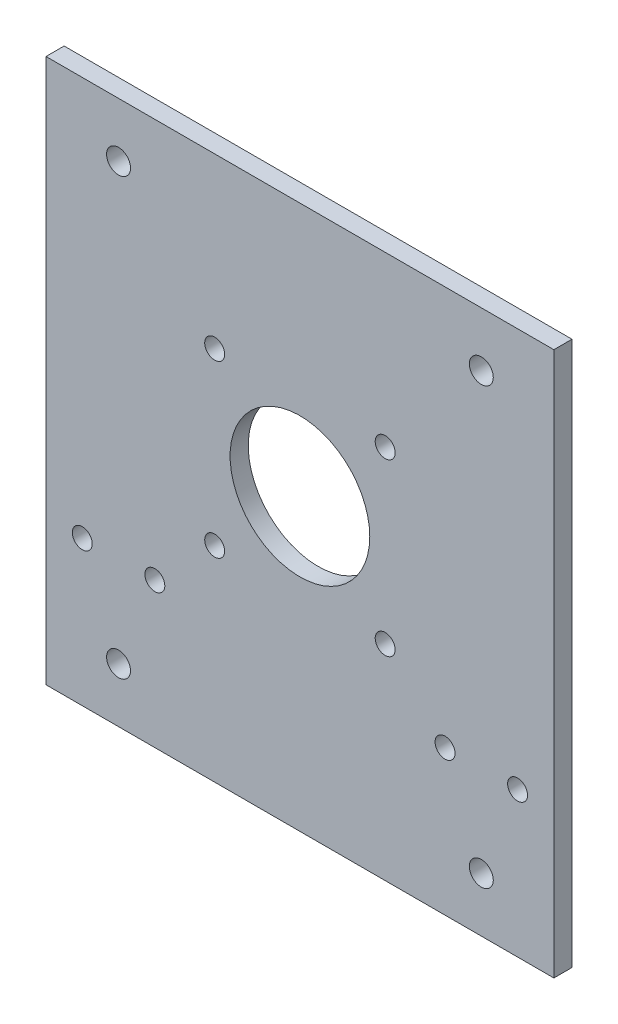
ISO-10303-21;
HEADER;
FILE_DESCRIPTION(('STEP AP214'),'2;1');
FILE_NAME('part.step','',(''),(''),'','','');
FILE_SCHEMA(('AUTOMOTIVE_DESIGN { 1 0 10303 214 1 1 1 1 }'));
ENDSEC;
DATA;
#1=APPLICATION_CONTEXT('core data for automotive mechanical design processes');
#2=APPLICATION_PROTOCOL_DEFINITION('international standard','automotive_design',2000,#1);
#3=PRODUCT_CONTEXT('',#1,'mechanical');
#4=PRODUCT('Part','Part','',(#3));
#5=PRODUCT_RELATED_PRODUCT_CATEGORY('part','',(#4));
#6=PRODUCT_DEFINITION_FORMATION('','',#4);
#7=PRODUCT_DEFINITION_CONTEXT('part definition',#1,'design');
#8=PRODUCT_DEFINITION('design','',#6,#7);
#9=PRODUCT_DEFINITION_SHAPE('','',#8);
#10=(LENGTH_UNIT() NAMED_UNIT(*) SI_UNIT(.MILLI.,.METRE.));
#11=(NAMED_UNIT(*) PLANE_ANGLE_UNIT() SI_UNIT($,.RADIAN.));
#12=(NAMED_UNIT(*) SI_UNIT($,.STERADIAN.) SOLID_ANGLE_UNIT());
#13=UNCERTAINTY_MEASURE_WITH_UNIT(LENGTH_MEASURE(1.E-05),#10,'distance_accuracy_value','');
#14=(GEOMETRIC_REPRESENTATION_CONTEXT(3) GLOBAL_UNCERTAINTY_ASSIGNED_CONTEXT((#13)) GLOBAL_UNIT_ASSIGNED_CONTEXT((#10,
#11,#12)) REPRESENTATION_CONTEXT('',''));
#15=CARTESIAN_POINT('',(0.,0.,0.));
#16=DIRECTION('',(0.,0.,1.));
#17=DIRECTION('',(1.,0.,0.));
#18=AXIS2_PLACEMENT_3D('',#15,#16,#17);
#19=CARTESIAN_POINT('',(0.,0.,0.));
#20=DIRECTION('',(0.,0.,-1.));
#21=DIRECTION('',(-1.,0.,0.));
#22=AXIS2_PLACEMENT_3D('',#19,#20,#21);
#23=PLANE('',#22);
#24=CARTESIAN_POINT('',(50.,49.,0.));
#25=DIRECTION('',(0.,0.,-1.));
#26=DIRECTION('',(-1.,0.,0.));
#27=AXIS2_PLACEMENT_3D('',#24,#25,#26);
#28=CIRCLE('',#27,3.3);
#29=CARTESIAN_POINT('',(46.7,49.,0.));
#30=VERTEX_POINT('',#29);
#31=EDGE_CURVE('E177',#30,#30,#28,.F.);
#32=ORIENTED_EDGE('',*,*,#31,.T.);
#33=EDGE_LOOP('',(#32));
#34=FACE_BOUND('',#33,.T.);
#35=CARTESIAN_POINT('',(23.5000000000005,-29.5000000000003,0.));
#36=DIRECTION('',(0.,0.,1.));
#37=DIRECTION('',(1.,0.,0.));
#38=AXIS2_PLACEMENT_3D('',#35,#36,#37);
#39=CIRCLE('',#38,2.75000000000001);
#40=CARTESIAN_POINT('',(26.2500000000005,-29.5000000000003,0.));
#41=VERTEX_POINT('',#40);
#42=EDGE_CURVE('E136',#41,#41,#39,.T.);
#43=ORIENTED_EDGE('',*,*,#42,.T.);
#44=EDGE_LOOP('',(#43));
#45=FACE_BOUND('',#44,.T.);
#46=CARTESIAN_POINT('',(-23.5,17.4999999999994,0.));
#47=DIRECTION('',(0.,0.,1.));
#48=DIRECTION('',(1.,0.,0.));
#49=AXIS2_PLACEMENT_3D('',#46,#47,#48);
#50=CIRCLE('',#49,2.74999999999999);
#51=CARTESIAN_POINT('',(-20.75,17.4999999999994,0.));
#52=VERTEX_POINT('',#51);
#53=EDGE_CURVE('E124',#52,#52,#50,.T.);
#54=ORIENTED_EDGE('',*,*,#53,.T.);
#55=EDGE_LOOP('',(#54));
#56=FACE_BOUND('',#55,.T.);
#57=CARTESIAN_POINT('',(23.5,17.4999999999997,0.));
#58=DIRECTION('',(0.,0.,1.));
#59=DIRECTION('',(1.,0.,0.));
#60=AXIS2_PLACEMENT_3D('',#57,#58,#59);
#61=CIRCLE('',#60,2.75000000000001);
#62=CARTESIAN_POINT('',(26.25,17.4999999999997,0.));
#63=VERTEX_POINT('',#62);
#64=EDGE_CURVE('E112',#63,#63,#61,.T.);
#65=ORIENTED_EDGE('',*,*,#64,.T.);
#66=EDGE_LOOP('',(#65));
#67=FACE_BOUND('',#66,.T.);
#68=DIRECTION('',(0.,1.,0.));
#69=VECTOR('',#68,1.);
#70=CARTESIAN_POINT('',(70.,-86.,0.));
#71=LINE('',#70,#69);
#72=CARTESIAN_POINT('',(70.,-86.,0.));
#73=VERTEX_POINT('',#72);
#74=CARTESIAN_POINT('',(70.,64.,0.));
#75=VERTEX_POINT('',#74);
#76=EDGE_CURVE('E98',#73,#75,#71,.T.);
#77=ORIENTED_EDGE('',*,*,#76,.F.);
#78=DIRECTION('',(1.,0.,0.));
#79=VECTOR('',#78,1.);
#80=CARTESIAN_POINT('',(-70.,-86.,0.));
#81=LINE('',#80,#79);
#82=CARTESIAN_POINT('',(-70.,-86.,0.));
#83=VERTEX_POINT('',#82);
#84=EDGE_CURVE('E73',#83,#73,#81,.T.);
#85=ORIENTED_EDGE('',*,*,#84,.F.);
#86=DIRECTION('',(0.,-1.,0.));
#87=VECTOR('',#86,1.);
#88=CARTESIAN_POINT('',(-70.,-86.,0.));
#89=LINE('',#88,#87);
#90=CARTESIAN_POINT('',(-70.,64.,0.));
#91=VERTEX_POINT('',#90);
#92=EDGE_CURVE('E67',#91,#83,#89,.T.);
#93=ORIENTED_EDGE('',*,*,#92,.F.);
#94=DIRECTION('',(-1.,0.,0.));
#95=VECTOR('',#94,1.);
#96=CARTESIAN_POINT('',(-70.,64.,0.));
#97=LINE('',#96,#95);
#98=EDGE_CURVE('E90',#75,#91,#97,.T.);
#99=ORIENTED_EDGE('',*,*,#98,.F.);
#100=EDGE_LOOP('',(#77,#85,#93,#99));
#101=FACE_BOUND('',#100,.T.);
#102=CARTESIAN_POINT('',(0.,-6.,0.));
#103=DIRECTION('',(0.,0.,1.));
#104=DIRECTION('',(1.,0.,0.));
#105=AXIS2_PLACEMENT_3D('',#102,#103,#104);
#106=CIRCLE('',#105,19.2499999999999);
#107=CARTESIAN_POINT('',(19.2499999999999,-6.,0.));
#108=VERTEX_POINT('',#107);
#109=EDGE_CURVE('E118',#108,#108,#106,.T.);
#110=ORIENTED_EDGE('',*,*,#109,.T.);
#111=EDGE_LOOP('',(#110));
#112=FACE_BOUND('',#111,.T.);
#113=CARTESIAN_POINT('',(-23.4999999999995,-29.5000000000006,0.));
#114=DIRECTION('',(0.,0.,1.));
#115=DIRECTION('',(1.,0.,0.));
#116=AXIS2_PLACEMENT_3D('',#113,#114,#115);
#117=CIRCLE('',#116,2.74999999999999);
#118=CARTESIAN_POINT('',(-20.7499999999995,-29.5000000000006,0.));
#119=VERTEX_POINT('',#118);
#120=EDGE_CURVE('E130',#119,#119,#117,.T.);
#121=ORIENTED_EDGE('',*,*,#120,.T.);
#122=EDGE_LOOP('',(#121));
#123=FACE_BOUND('',#122,.T.);
#124=CARTESIAN_POINT('',(40.,-46.,0.));
#125=DIRECTION('',(0.,0.,-1.));
#126=DIRECTION('',(-1.,0.,0.));
#127=AXIS2_PLACEMENT_3D('',#124,#125,#126);
#128=CIRCLE('',#127,2.75);
#129=CARTESIAN_POINT('',(37.25,-46.,0.));
#130=VERTEX_POINT('',#129);
#131=EDGE_CURVE('E144',#130,#130,#128,.T.);
#132=ORIENTED_EDGE('',*,*,#131,.F.);
#133=EDGE_LOOP('',(#132));
#134=FACE_BOUND('',#133,.T.);
#135=CARTESIAN_POINT('',(-40.,-46.,0.));
#136=DIRECTION('',(0.,0.,-1.));
#137=DIRECTION('',(-1.,0.,0.));
#138=AXIS2_PLACEMENT_3D('',#135,#136,#137);
#139=CIRCLE('',#138,2.75);
#140=CARTESIAN_POINT('',(-42.75,-46.,0.));
#141=VERTEX_POINT('',#140);
#142=EDGE_CURVE('E150',#141,#141,#139,.T.);
#143=ORIENTED_EDGE('',*,*,#142,.F.);
#144=EDGE_LOOP('',(#143));
#145=FACE_BOUND('',#144,.T.);
#146=CARTESIAN_POINT('',(-60.,-46.,0.));
#147=DIRECTION('',(0.,0.,-1.));
#148=DIRECTION('',(-1.,0.,0.));
#149=AXIS2_PLACEMENT_3D('',#146,#147,#148);
#150=CIRCLE('',#149,2.75);
#151=CARTESIAN_POINT('',(-62.75,-46.,0.));
#152=VERTEX_POINT('',#151);
#153=EDGE_CURVE('E156',#152,#152,#150,.T.);
#154=ORIENTED_EDGE('',*,*,#153,.F.);
#155=EDGE_LOOP('',(#154));
#156=FACE_BOUND('',#155,.T.);
#157=CARTESIAN_POINT('',(60.,-46.,0.));
#158=DIRECTION('',(0.,0.,-1.));
#159=DIRECTION('',(-1.,0.,0.));
#160=AXIS2_PLACEMENT_3D('',#157,#158,#159);
#161=CIRCLE('',#160,2.75);
#162=CARTESIAN_POINT('',(57.25,-46.,0.));
#163=VERTEX_POINT('',#162);
#164=EDGE_CURVE('E162',#163,#163,#161,.T.);
#165=ORIENTED_EDGE('',*,*,#164,.F.);
#166=EDGE_LOOP('',(#165));
#167=FACE_BOUND('',#166,.T.);
#168=CARTESIAN_POINT('',(-49.9999999999988,-71.,0.));
#169=DIRECTION('',(0.,0.,-1.));
#170=DIRECTION('',(-1.,0.,0.));
#171=AXIS2_PLACEMENT_3D('',#168,#169,#170);
#172=CIRCLE('',#171,3.3);
#173=CARTESIAN_POINT('',(-53.2999999999988,-71.,0.));
#174=VERTEX_POINT('',#173);
#175=EDGE_CURVE('E165',#174,#174,#172,.F.);
#176=ORIENTED_EDGE('',*,*,#175,.T.);
#177=EDGE_LOOP('',(#176));
#178=FACE_BOUND('',#177,.T.);
#179=CARTESIAN_POINT('',(50.0000000000012,-71.,0.));
#180=DIRECTION('',(0.,0.,-1.));
#181=DIRECTION('',(-1.,0.,0.));
#182=AXIS2_PLACEMENT_3D('',#179,#180,#181);
#183=CIRCLE('',#182,3.3);
#184=CARTESIAN_POINT('',(46.7000000000012,-71.,0.));
#185=VERTEX_POINT('',#184);
#186=EDGE_CURVE('E171',#185,#185,#183,.F.);
#187=ORIENTED_EDGE('',*,*,#186,.T.);
#188=EDGE_LOOP('',(#187));
#189=FACE_BOUND('',#188,.T.);
#190=CARTESIAN_POINT('',(-50.,49.,0.));
#191=DIRECTION('',(0.,0.,-1.));
#192=DIRECTION('',(-1.,0.,0.));
#193=AXIS2_PLACEMENT_3D('',#190,#191,#192);
#194=CIRCLE('',#193,3.3);
#195=CARTESIAN_POINT('',(-53.3,49.,0.));
#196=VERTEX_POINT('',#195);
#197=EDGE_CURVE('E183',#196,#196,#194,.F.);
#198=ORIENTED_EDGE('',*,*,#197,.T.);
#199=EDGE_LOOP('',(#198));
#200=FACE_BOUND('',#199,.T.);
#201=ADVANCED_FACE('F33',(#34,#45,#56,#67,#101,#112,#123,#134,#145,#156,#167,#178,#189,#200),
#23,.T.);
#202=CARTESIAN_POINT('',(0.,0.,5.));
#203=DIRECTION('',(0.,0.,-1.));
#204=DIRECTION('',(-1.,0.,0.));
#205=AXIS2_PLACEMENT_3D('',#202,#203,#204);
#206=PLANE('',#205);
#207=CARTESIAN_POINT('',(-50.,49.,5.));
#208=DIRECTION('',(0.,0.,1.));
#209=DIRECTION('',(1.,0.,0.));
#210=AXIS2_PLACEMENT_3D('',#207,#208,#209);
#211=CIRCLE('',#210,3.3);
#212=CARTESIAN_POINT('',(-46.7,49.,5.));
#213=VERTEX_POINT('',#212);
#214=EDGE_CURVE('E186',#213,#213,#211,.T.);
#215=ORIENTED_EDGE('',*,*,#214,.F.);
#216=EDGE_LOOP('',(#215));
#217=FACE_BOUND('',#216,.T.);
#218=CARTESIAN_POINT('',(50.,49.,5.));
#219=DIRECTION('',(0.,0.,1.));
#220=DIRECTION('',(1.,0.,0.));
#221=AXIS2_PLACEMENT_3D('',#218,#219,#220);
#222=CIRCLE('',#221,3.3);
#223=CARTESIAN_POINT('',(53.3,49.,5.));
#224=VERTEX_POINT('',#223);
#225=EDGE_CURVE('E180',#224,#224,#222,.T.);
#226=ORIENTED_EDGE('',*,*,#225,.F.);
#227=EDGE_LOOP('',(#226));
#228=FACE_BOUND('',#227,.T.);
#229=CARTESIAN_POINT('',(50.0000000000012,-71.,5.));
#230=DIRECTION('',(0.,0.,1.));
#231=DIRECTION('',(1.,0.,0.));
#232=AXIS2_PLACEMENT_3D('',#229,#230,#231);
#233=CIRCLE('',#232,3.3);
#234=CARTESIAN_POINT('',(53.3000000000012,-71.,5.));
#235=VERTEX_POINT('',#234);
#236=EDGE_CURVE('E174',#235,#235,#233,.T.);
#237=ORIENTED_EDGE('',*,*,#236,.F.);
#238=EDGE_LOOP('',(#237));
#239=FACE_BOUND('',#238,.T.);
#240=CARTESIAN_POINT('',(-49.9999999999988,-71.,5.));
#241=DIRECTION('',(0.,0.,1.));
#242=DIRECTION('',(1.,0.,0.));
#243=AXIS2_PLACEMENT_3D('',#240,#241,#242);
#244=CIRCLE('',#243,3.3);
#245=CARTESIAN_POINT('',(-46.6999999999988,-71.,5.));
#246=VERTEX_POINT('',#245);
#247=EDGE_CURVE('E168',#246,#246,#244,.T.);
#248=ORIENTED_EDGE('',*,*,#247,.F.);
#249=EDGE_LOOP('',(#248));
#250=FACE_BOUND('',#249,.T.);
#251=CARTESIAN_POINT('',(60.,-46.,5.));
#252=DIRECTION('',(0.,0.,-1.));
#253=DIRECTION('',(-1.,0.,0.));
#254=AXIS2_PLACEMENT_3D('',#251,#252,#253);
#255=CIRCLE('',#254,2.75);
#256=CARTESIAN_POINT('',(57.25,-46.,5.));
#257=VERTEX_POINT('',#256);
#258=EDGE_CURVE('E159',#257,#257,#255,.T.);
#259=ORIENTED_EDGE('',*,*,#258,.T.);
#260=EDGE_LOOP('',(#259));
#261=FACE_BOUND('',#260,.T.);
#262=CARTESIAN_POINT('',(-60.,-46.,5.));
#263=DIRECTION('',(0.,0.,-1.));
#264=DIRECTION('',(-1.,0.,0.));
#265=AXIS2_PLACEMENT_3D('',#262,#263,#264);
#266=CIRCLE('',#265,2.75);
#267=CARTESIAN_POINT('',(-62.75,-46.,5.));
#268=VERTEX_POINT('',#267);
#269=EDGE_CURVE('E153',#268,#268,#266,.T.);
#270=ORIENTED_EDGE('',*,*,#269,.T.);
#271=EDGE_LOOP('',(#270));
#272=FACE_BOUND('',#271,.T.);
#273=CARTESIAN_POINT('',(-40.,-46.,5.));
#274=DIRECTION('',(0.,0.,-1.));
#275=DIRECTION('',(-1.,0.,0.));
#276=AXIS2_PLACEMENT_3D('',#273,#274,#275);
#277=CIRCLE('',#276,2.75);
#278=CARTESIAN_POINT('',(-42.75,-46.,5.));
#279=VERTEX_POINT('',#278);
#280=EDGE_CURVE('E147',#279,#279,#277,.T.);
#281=ORIENTED_EDGE('',*,*,#280,.T.);
#282=EDGE_LOOP('',(#281));
#283=FACE_BOUND('',#282,.T.);
#284=CARTESIAN_POINT('',(40.,-46.,5.));
#285=DIRECTION('',(0.,0.,-1.));
#286=DIRECTION('',(-1.,0.,0.));
#287=AXIS2_PLACEMENT_3D('',#284,#285,#286);
#288=CIRCLE('',#287,2.75);
#289=CARTESIAN_POINT('',(37.25,-46.,5.));
#290=VERTEX_POINT('',#289);
#291=EDGE_CURVE('E139',#290,#290,#288,.T.);
#292=ORIENTED_EDGE('',*,*,#291,.T.);
#293=EDGE_LOOP('',(#292));
#294=FACE_BOUND('',#293,.T.);
#295=DIRECTION('',(0.,1.,0.));
#296=VECTOR('',#295,1.);
#297=CARTESIAN_POINT('',(70.,-86.,5.));
#298=LINE('',#297,#296);
#299=CARTESIAN_POINT('',(70.,-86.,5.));
#300=VERTEX_POINT('',#299);
#301=CARTESIAN_POINT('',(70.,64.,5.));
#302=VERTEX_POINT('',#301);
#303=EDGE_CURVE('E86',#300,#302,#298,.T.);
#304=ORIENTED_EDGE('',*,*,#303,.T.);
#305=DIRECTION('',(-1.,0.,0.));
#306=VECTOR('',#305,1.);
#307=CARTESIAN_POINT('',(-70.,64.,5.));
#308=LINE('',#307,#306);
#309=CARTESIAN_POINT('',(-70.,64.,5.));
#310=VERTEX_POINT('',#309);
#311=EDGE_CURVE('E80',#302,#310,#308,.T.);
#312=ORIENTED_EDGE('',*,*,#311,.T.);
#313=DIRECTION('',(0.,-1.,0.));
#314=VECTOR('',#313,1.);
#315=CARTESIAN_POINT('',(-70.,-86.,5.));
#316=LINE('',#315,#314);
#317=CARTESIAN_POINT('',(-70.,-86.,5.));
#318=VERTEX_POINT('',#317);
#319=EDGE_CURVE('E84',#310,#318,#316,.T.);
#320=ORIENTED_EDGE('',*,*,#319,.T.);
#321=DIRECTION('',(1.,0.,0.));
#322=VECTOR('',#321,1.);
#323=CARTESIAN_POINT('',(-70.,-86.,5.));
#324=LINE('',#323,#322);
#325=EDGE_CURVE('E50',#318,#300,#324,.T.);
#326=ORIENTED_EDGE('',*,*,#325,.T.);
#327=EDGE_LOOP('',(#304,#312,#320,#326));
#328=FACE_BOUND('',#327,.T.);
#329=CARTESIAN_POINT('',(23.5,17.4999999999997,5.));
#330=DIRECTION('',(0.,0.,1.));
#331=DIRECTION('',(1.,0.,0.));
#332=AXIS2_PLACEMENT_3D('',#329,#330,#331);
#333=CIRCLE('',#332,2.75000000000001);
#334=CARTESIAN_POINT('',(26.25,17.4999999999997,5.));
#335=VERTEX_POINT('',#334);
#336=EDGE_CURVE('E101',#335,#335,#333,.T.);
#337=ORIENTED_EDGE('',*,*,#336,.F.);
#338=EDGE_LOOP('',(#337));
#339=FACE_BOUND('',#338,.T.);
#340=CARTESIAN_POINT('',(0.,-6.,5.));
#341=DIRECTION('',(0.,0.,1.));
#342=DIRECTION('',(1.,0.,0.));
#343=AXIS2_PLACEMENT_3D('',#340,#341,#342);
#344=CIRCLE('',#343,19.2499999999999);
#345=CARTESIAN_POINT('',(19.2499999999999,-6.,5.));
#346=VERTEX_POINT('',#345);
#347=EDGE_CURVE('E115',#346,#346,#344,.T.);
#348=ORIENTED_EDGE('',*,*,#347,.F.);
#349=EDGE_LOOP('',(#348));
#350=FACE_BOUND('',#349,.T.);
#351=CARTESIAN_POINT('',(-23.5,17.4999999999994,5.));
#352=DIRECTION('',(0.,0.,1.));
#353=DIRECTION('',(1.,0.,0.));
#354=AXIS2_PLACEMENT_3D('',#351,#352,#353);
#355=CIRCLE('',#354,2.74999999999999);
#356=CARTESIAN_POINT('',(-20.75,17.4999999999994,5.));
#357=VERTEX_POINT('',#356);
#358=EDGE_CURVE('E121',#357,#357,#355,.T.);
#359=ORIENTED_EDGE('',*,*,#358,.F.);
#360=EDGE_LOOP('',(#359));
#361=FACE_BOUND('',#360,.T.);
#362=CARTESIAN_POINT('',(-23.4999999999995,-29.5000000000006,5.));
#363=DIRECTION('',(0.,0.,1.));
#364=DIRECTION('',(1.,0.,0.));
#365=AXIS2_PLACEMENT_3D('',#362,#363,#364);
#366=CIRCLE('',#365,2.74999999999999);
#367=CARTESIAN_POINT('',(-20.7499999999995,-29.5000000000006,5.));
#368=VERTEX_POINT('',#367);
#369=EDGE_CURVE('E127',#368,#368,#366,.T.);
#370=ORIENTED_EDGE('',*,*,#369,.F.);
#371=EDGE_LOOP('',(#370));
#372=FACE_BOUND('',#371,.T.);
#373=CARTESIAN_POINT('',(23.5000000000005,-29.5000000000003,5.));
#374=DIRECTION('',(0.,0.,1.));
#375=DIRECTION('',(1.,0.,0.));
#376=AXIS2_PLACEMENT_3D('',#373,#374,#375);
#377=CIRCLE('',#376,2.75000000000001);
#378=CARTESIAN_POINT('',(26.2500000000005,-29.5000000000003,5.));
#379=VERTEX_POINT('',#378);
#380=EDGE_CURVE('E133',#379,#379,#377,.T.);
#381=ORIENTED_EDGE('',*,*,#380,.F.);
#382=EDGE_LOOP('',(#381));
#383=FACE_BOUND('',#382,.T.);
#384=ADVANCED_FACE('F81',(#217,#228,#239,#250,#261,#272,#283,#294,#328,#339,#350,#361,#372,
#383),#206,.F.);
#385=CARTESIAN_POINT('',(70.,-86.,5.));
#386=DIRECTION('',(-1.,0.,0.));
#387=DIRECTION('',(0.,-1.,0.));
#388=AXIS2_PLACEMENT_3D('',#385,#386,#387);
#389=PLANE('',#388);
#390=ORIENTED_EDGE('',*,*,#76,.T.);
#391=DIRECTION('',(0.,0.,-1.));
#392=VECTOR('',#391,1.);
#393=CARTESIAN_POINT('',(70.,64.,5.));
#394=LINE('',#393,#392);
#395=EDGE_CURVE('E11',#302,#75,#394,.T.);
#396=ORIENTED_EDGE('',*,*,#395,.F.);
#397=ORIENTED_EDGE('',*,*,#303,.F.);
#398=DIRECTION('',(0.,0.,-1.));
#399=VECTOR('',#398,1.);
#400=CARTESIAN_POINT('',(70.,-86.,5.));
#401=LINE('',#400,#399);
#402=EDGE_CURVE('E94',#300,#73,#401,.T.);
#403=ORIENTED_EDGE('',*,*,#402,.T.);
#404=EDGE_LOOP('',(#390,#396,#397,#403));
#405=FACE_BOUND('',#404,.T.);
#406=ADVANCED_FACE('F35',(#405),#389,.F.);
#407=CARTESIAN_POINT('',(-70.,64.,5.));
#408=DIRECTION('',(0.,-1.,0.));
#409=DIRECTION('',(0.,0.,-1.));
#410=AXIS2_PLACEMENT_3D('',#407,#408,#409);
#411=PLANE('',#410);
#412=ORIENTED_EDGE('',*,*,#98,.T.);
#413=DIRECTION('',(0.,0.,-1.));
#414=VECTOR('',#413,1.);
#415=CARTESIAN_POINT('',(-70.,64.,5.));
#416=LINE('',#415,#414);
#417=EDGE_CURVE('E42',#310,#91,#416,.T.);
#418=ORIENTED_EDGE('',*,*,#417,.F.);
#419=ORIENTED_EDGE('',*,*,#311,.F.);
#420=ORIENTED_EDGE('',*,*,#395,.T.);
#421=EDGE_LOOP('',(#412,#418,#419,#420));
#422=FACE_BOUND('',#421,.T.);
#423=ADVANCED_FACE('F89',(#422),#411,.F.);
#424=CARTESIAN_POINT('',(-70.,-86.,5.));
#425=DIRECTION('',(1.,0.,0.));
#426=DIRECTION('',(0.,1.,0.));
#427=AXIS2_PLACEMENT_3D('',#424,#425,#426);
#428=PLANE('',#427);
#429=ORIENTED_EDGE('',*,*,#92,.T.);
#430=DIRECTION('',(0.,0.,-1.));
#431=VECTOR('',#430,1.);
#432=CARTESIAN_POINT('',(-70.,-86.,5.));
#433=LINE('',#432,#431);
#434=EDGE_CURVE('E91',#318,#83,#433,.T.);
#435=ORIENTED_EDGE('',*,*,#434,.F.);
#436=ORIENTED_EDGE('',*,*,#319,.F.);
#437=ORIENTED_EDGE('',*,*,#417,.T.);
#438=EDGE_LOOP('',(#429,#435,#436,#437));
#439=FACE_BOUND('',#438,.T.);
#440=ADVANCED_FACE('F92',(#439),#428,.F.);
#441=CARTESIAN_POINT('',(-70.,-86.,5.));
#442=DIRECTION('',(0.,1.,0.));
#443=DIRECTION('',(0.,0.,1.));
#444=AXIS2_PLACEMENT_3D('',#441,#442,#443);
#445=PLANE('',#444);
#446=ORIENTED_EDGE('',*,*,#84,.T.);
#447=ORIENTED_EDGE('',*,*,#402,.F.);
#448=ORIENTED_EDGE('',*,*,#325,.F.);
#449=ORIENTED_EDGE('',*,*,#434,.T.);
#450=EDGE_LOOP('',(#446,#447,#448,#449));
#451=FACE_BOUND('',#450,.T.);
#452=ADVANCED_FACE('F106',(#451),#445,.F.);
#453=CARTESIAN_POINT('',(23.5,17.4999999999997,5.));
#454=DIRECTION('',(0.,0.,-1.));
#455=DIRECTION('',(-1.,0.,0.));
#456=AXIS2_PLACEMENT_3D('',#453,#454,#455);
#457=CYLINDRICAL_SURFACE('',#456,2.75000000000001);
#458=ORIENTED_EDGE('',*,*,#336,.T.);
#459=EDGE_LOOP('',(#458));
#460=FACE_BOUND('',#459,.T.);
#461=ORIENTED_EDGE('',*,*,#64,.F.);
#462=EDGE_LOOP('',(#461));
#463=FACE_BOUND('',#462,.T.);
#464=ADVANCED_FACE('F275',(#460,#463),#457,.F.);
#465=CARTESIAN_POINT('',(0.,-6.,5.));
#466=DIRECTION('',(0.,0.,-1.));
#467=DIRECTION('',(-1.,0.,0.));
#468=AXIS2_PLACEMENT_3D('',#465,#466,#467);
#469=CYLINDRICAL_SURFACE('',#468,19.2499999999999);
#470=ORIENTED_EDGE('',*,*,#347,.T.);
#471=EDGE_LOOP('',(#470));
#472=FACE_BOUND('',#471,.T.);
#473=ORIENTED_EDGE('',*,*,#109,.F.);
#474=EDGE_LOOP('',(#473));
#475=FACE_BOUND('',#474,.T.);
#476=ADVANCED_FACE('F271',(#472,#475),#469,.F.);
#477=CARTESIAN_POINT('',(-23.5,17.4999999999994,5.));
#478=DIRECTION('',(0.,0.,-1.));
#479=DIRECTION('',(-1.,0.,0.));
#480=AXIS2_PLACEMENT_3D('',#477,#478,#479);
#481=CYLINDRICAL_SURFACE('',#480,2.74999999999999);
#482=ORIENTED_EDGE('',*,*,#358,.T.);
#483=EDGE_LOOP('',(#482));
#484=FACE_BOUND('',#483,.T.);
#485=ORIENTED_EDGE('',*,*,#53,.F.);
#486=EDGE_LOOP('',(#485));
#487=FACE_BOUND('',#486,.T.);
#488=ADVANCED_FACE('F267',(#484,#487),#481,.F.);
#489=CARTESIAN_POINT('',(-23.4999999999995,-29.5000000000006,5.));
#490=DIRECTION('',(0.,0.,-1.));
#491=DIRECTION('',(-1.,0.,0.));
#492=AXIS2_PLACEMENT_3D('',#489,#490,#491);
#493=CYLINDRICAL_SURFACE('',#492,2.74999999999999);
#494=ORIENTED_EDGE('',*,*,#369,.T.);
#495=EDGE_LOOP('',(#494));
#496=FACE_BOUND('',#495,.T.);
#497=ORIENTED_EDGE('',*,*,#120,.F.);
#498=EDGE_LOOP('',(#497));
#499=FACE_BOUND('',#498,.T.);
#500=ADVANCED_FACE('F263',(#496,#499),#493,.F.);
#501=CARTESIAN_POINT('',(23.5000000000005,-29.5000000000003,5.));
#502=DIRECTION('',(0.,0.,-1.));
#503=DIRECTION('',(-1.,0.,0.));
#504=AXIS2_PLACEMENT_3D('',#501,#502,#503);
#505=CYLINDRICAL_SURFACE('',#504,2.75000000000001);
#506=ORIENTED_EDGE('',*,*,#380,.T.);
#507=EDGE_LOOP('',(#506));
#508=FACE_BOUND('',#507,.T.);
#509=ORIENTED_EDGE('',*,*,#42,.F.);
#510=EDGE_LOOP('',(#509));
#511=FACE_BOUND('',#510,.T.);
#512=ADVANCED_FACE('F213',(#508,#511),#505,.F.);
#513=CARTESIAN_POINT('',(40.,-46.,0.));
#514=DIRECTION('',(0.,0.,-1.));
#515=DIRECTION('',(-1.,0.,0.));
#516=AXIS2_PLACEMENT_3D('',#513,#514,#515);
#517=CYLINDRICAL_SURFACE('',#516,2.75);
#518=ORIENTED_EDGE('',*,*,#291,.F.);
#519=EDGE_LOOP('',(#518));
#520=FACE_BOUND('',#519,.T.);
#521=ORIENTED_EDGE('',*,*,#131,.T.);
#522=EDGE_LOOP('',(#521));
#523=FACE_BOUND('',#522,.T.);
#524=ADVANCED_FACE('F209',(#520,#523),#517,.F.);
#525=CARTESIAN_POINT('',(-40.,-46.,0.));
#526=DIRECTION('',(0.,0.,-1.));
#527=DIRECTION('',(-1.,0.,0.));
#528=AXIS2_PLACEMENT_3D('',#525,#526,#527);
#529=CYLINDRICAL_SURFACE('',#528,2.75);
#530=ORIENTED_EDGE('',*,*,#280,.F.);
#531=EDGE_LOOP('',(#530));
#532=FACE_BOUND('',#531,.T.);
#533=ORIENTED_EDGE('',*,*,#142,.T.);
#534=EDGE_LOOP('',(#533));
#535=FACE_BOUND('',#534,.T.);
#536=ADVANCED_FACE('F212',(#532,#535),#529,.F.);
#537=CARTESIAN_POINT('',(-60.,-46.,0.));
#538=DIRECTION('',(0.,0.,-1.));
#539=DIRECTION('',(-1.,0.,0.));
#540=AXIS2_PLACEMENT_3D('',#537,#538,#539);
#541=CYLINDRICAL_SURFACE('',#540,2.75);
#542=ORIENTED_EDGE('',*,*,#269,.F.);
#543=EDGE_LOOP('',(#542));
#544=FACE_BOUND('',#543,.T.);
#545=ORIENTED_EDGE('',*,*,#153,.T.);
#546=EDGE_LOOP('',(#545));
#547=FACE_BOUND('',#546,.T.);
#548=ADVANCED_FACE('F253',(#544,#547),#541,.F.);
#549=CARTESIAN_POINT('',(60.,-46.,0.));
#550=DIRECTION('',(0.,0.,-1.));
#551=DIRECTION('',(-1.,0.,0.));
#552=AXIS2_PLACEMENT_3D('',#549,#550,#551);
#553=CYLINDRICAL_SURFACE('',#552,2.75);
#554=ORIENTED_EDGE('',*,*,#258,.F.);
#555=EDGE_LOOP('',(#554));
#556=FACE_BOUND('',#555,.T.);
#557=ORIENTED_EDGE('',*,*,#164,.T.);
#558=EDGE_LOOP('',(#557));
#559=FACE_BOUND('',#558,.T.);
#560=ADVANCED_FACE('F249',(#556,#559),#553,.F.);
#561=CARTESIAN_POINT('',(-49.9999999999988,-71.,5.));
#562=DIRECTION('',(0.,0.,1.));
#563=DIRECTION('',(1.,0.,0.));
#564=AXIS2_PLACEMENT_3D('',#561,#562,#563);
#565=CYLINDRICAL_SURFACE('',#564,3.3);
#566=ORIENTED_EDGE('',*,*,#175,.F.);
#567=EDGE_LOOP('',(#566));
#568=FACE_BOUND('',#567,.T.);
#569=ORIENTED_EDGE('',*,*,#247,.T.);
#570=EDGE_LOOP('',(#569));
#571=FACE_BOUND('',#570,.T.);
#572=ADVANCED_FACE('F245',(#568,#571),#565,.F.);
#573=CARTESIAN_POINT('',(50.0000000000012,-71.,5.));
#574=DIRECTION('',(0.,0.,1.));
#575=DIRECTION('',(1.,0.,0.));
#576=AXIS2_PLACEMENT_3D('',#573,#574,#575);
#577=CYLINDRICAL_SURFACE('',#576,3.3);
#578=ORIENTED_EDGE('',*,*,#186,.F.);
#579=EDGE_LOOP('',(#578));
#580=FACE_BOUND('',#579,.T.);
#581=ORIENTED_EDGE('',*,*,#236,.T.);
#582=EDGE_LOOP('',(#581));
#583=FACE_BOUND('',#582,.T.);
#584=ADVANCED_FACE('F239',(#580,#583),#577,.F.);
#585=CARTESIAN_POINT('',(50.,49.,5.));
#586=DIRECTION('',(0.,0.,1.));
#587=DIRECTION('',(1.,0.,0.));
#588=AXIS2_PLACEMENT_3D('',#585,#586,#587);
#589=CYLINDRICAL_SURFACE('',#588,3.3);
#590=ORIENTED_EDGE('',*,*,#31,.F.);
#591=EDGE_LOOP('',(#590));
#592=FACE_BOUND('',#591,.T.);
#593=ORIENTED_EDGE('',*,*,#225,.T.);
#594=EDGE_LOOP('',(#593));
#595=FACE_BOUND('',#594,.T.);
#596=ADVANCED_FACE('F234',(#592,#595),#589,.F.);
#597=CARTESIAN_POINT('',(-50.,49.,5.));
#598=DIRECTION('',(0.,0.,1.));
#599=DIRECTION('',(1.,0.,0.));
#600=AXIS2_PLACEMENT_3D('',#597,#598,#599);
#601=CYLINDRICAL_SURFACE('',#600,3.3);
#602=ORIENTED_EDGE('',*,*,#197,.F.);
#603=EDGE_LOOP('',(#602));
#604=FACE_BOUND('',#603,.T.);
#605=ORIENTED_EDGE('',*,*,#214,.T.);
#606=EDGE_LOOP('',(#605));
#607=FACE_BOUND('',#606,.T.);
#608=ADVANCED_FACE('F190',(#604,#607),#601,.F.);
#609=CLOSED_SHELL('',(#201,#384,#406,#423,#440,#452,#464,#476,#488,#500,#512,#524,#536,#548,
#560,#572,#584,#596,#608));
#610=MANIFOLD_SOLID_BREP('B2',#609);
#611=ADVANCED_BREP_SHAPE_REPRESENTATION('',(#18,#610),#14);
#612=SHAPE_DEFINITION_REPRESENTATION(#9,#611);
ENDSEC;
END-ISO-10303-21;
